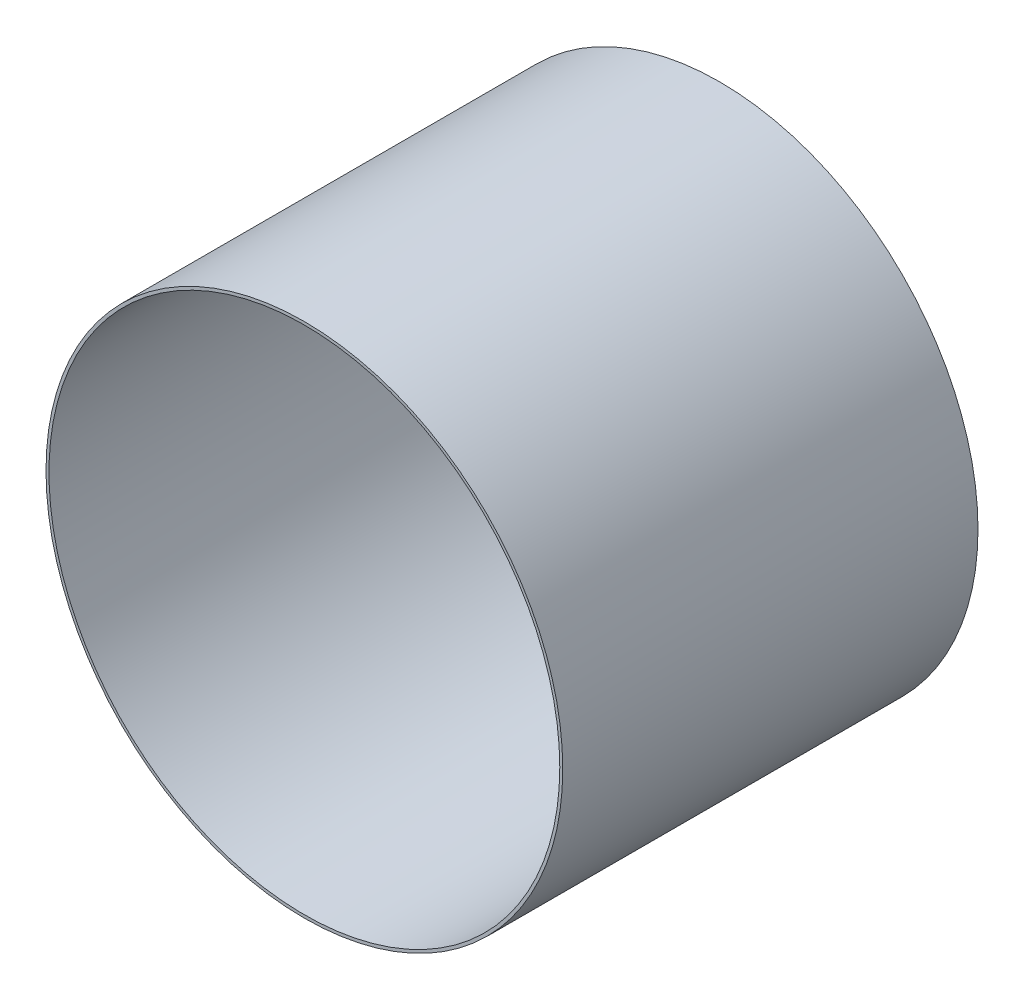
ISO-10303-21;
HEADER;
FILE_DESCRIPTION(('STEP AP214'),'2;1');
FILE_NAME('part.step','',(''),(''),'','','');
FILE_SCHEMA(('AUTOMOTIVE_DESIGN { 1 0 10303 214 1 1 1 1 }'));
ENDSEC;
DATA;
#1=APPLICATION_CONTEXT('core data for automotive mechanical design processes');
#2=APPLICATION_PROTOCOL_DEFINITION('international standard','automotive_design',2000,#1);
#3=PRODUCT_CONTEXT('',#1,'mechanical');
#4=PRODUCT('Part','Part','',(#3));
#5=PRODUCT_RELATED_PRODUCT_CATEGORY('part','',(#4));
#6=PRODUCT_DEFINITION_FORMATION('','',#4);
#7=PRODUCT_DEFINITION_CONTEXT('part definition',#1,'design');
#8=PRODUCT_DEFINITION('design','',#6,#7);
#9=PRODUCT_DEFINITION_SHAPE('','',#8);
#10=(LENGTH_UNIT() NAMED_UNIT(*) SI_UNIT(.MILLI.,.METRE.));
#11=(NAMED_UNIT(*) PLANE_ANGLE_UNIT() SI_UNIT($,.RADIAN.));
#12=(NAMED_UNIT(*) SI_UNIT($,.STERADIAN.) SOLID_ANGLE_UNIT());
#13=UNCERTAINTY_MEASURE_WITH_UNIT(LENGTH_MEASURE(1.E-05),#10,'distance_accuracy_value','');
#14=(GEOMETRIC_REPRESENTATION_CONTEXT(3) GLOBAL_UNCERTAINTY_ASSIGNED_CONTEXT((#13)) GLOBAL_UNIT_ASSIGNED_CONTEXT((#10,
#11,#12)) REPRESENTATION_CONTEXT('',''));
#15=CARTESIAN_POINT('',(0.,0.,0.));
#16=DIRECTION('',(0.,0.,1.));
#17=DIRECTION('',(1.,0.,0.));
#18=AXIS2_PLACEMENT_3D('',#15,#16,#17);
#19=CARTESIAN_POINT('',(0.,0.,140.));
#20=DIRECTION('',(0.,0.,1.));
#21=DIRECTION('',(1.,0.,0.));
#22=AXIS2_PLACEMENT_3D('',#19,#20,#21);
#23=PLANE('',#22);
#24=CARTESIAN_POINT('',(0.,0.,140.));
#25=DIRECTION('',(0.,0.,1.));
#26=DIRECTION('',(1.,0.,0.));
#27=AXIS2_PLACEMENT_3D('',#24,#25,#26);
#28=CIRCLE('',#27,87.110994186458);
#29=CARTESIAN_POINT('',(87.110994186458,0.,140.));
#30=VERTEX_POINT('',#29);
#31=EDGE_CURVE('E10',#30,#30,#28,.T.);
#32=ORIENTED_EDGE('',*,*,#31,.T.);
#33=EDGE_LOOP('',(#32));
#34=FACE_BOUND('',#33,.T.);
#35=CARTESIAN_POINT('',(0.,0.,140.));
#36=DIRECTION('',(0.,0.,1.));
#37=DIRECTION('',(1.,0.,0.));
#38=AXIS2_PLACEMENT_3D('',#35,#36,#37);
#39=CIRCLE('',#38,86.110994186458);
#40=CARTESIAN_POINT('',(86.110994186458,0.,140.));
#41=VERTEX_POINT('',#40);
#42=EDGE_CURVE('E42',#41,#41,#39,.T.);
#43=ORIENTED_EDGE('',*,*,#42,.F.);
#44=EDGE_LOOP('',(#43));
#45=FACE_BOUND('',#44,.T.);
#46=ADVANCED_FACE('F31',(#34,#45),#23,.T.);
#47=CARTESIAN_POINT('',(0.,0.,0.));
#48=DIRECTION('',(0.,0.,1.));
#49=DIRECTION('',(1.,0.,0.));
#50=AXIS2_PLACEMENT_3D('',#47,#48,#49);
#51=PLANE('',#50);
#52=CARTESIAN_POINT('',(0.,0.,0.));
#53=DIRECTION('',(0.,0.,1.));
#54=DIRECTION('',(1.,0.,0.));
#55=AXIS2_PLACEMENT_3D('',#52,#53,#54);
#56=CIRCLE('',#55,87.110994186458);
#57=CARTESIAN_POINT('',(87.110994186458,0.,0.));
#58=VERTEX_POINT('',#57);
#59=EDGE_CURVE('E35',#58,#58,#56,.T.);
#60=ORIENTED_EDGE('',*,*,#59,.F.);
#61=EDGE_LOOP('',(#60));
#62=FACE_BOUND('',#61,.T.);
#63=CARTESIAN_POINT('',(0.,0.,0.));
#64=DIRECTION('',(0.,0.,1.));
#65=DIRECTION('',(1.,0.,0.));
#66=AXIS2_PLACEMENT_3D('',#63,#64,#65);
#67=CIRCLE('',#66,86.110994186458);
#68=CARTESIAN_POINT('',(86.110994186458,0.,0.));
#69=VERTEX_POINT('',#68);
#70=EDGE_CURVE('E44',#69,#69,#67,.T.);
#71=ORIENTED_EDGE('',*,*,#70,.T.);
#72=EDGE_LOOP('',(#71));
#73=FACE_BOUND('',#72,.T.);
#74=ADVANCED_FACE('F54',(#62,#73),#51,.F.);
#75=CARTESIAN_POINT('',(0.,0.,140.));
#76=DIRECTION('',(0.,0.,-1.));
#77=DIRECTION('',(-1.,0.,0.));
#78=AXIS2_PLACEMENT_3D('',#75,#76,#77);
#79=CYLINDRICAL_SURFACE('',#78,87.110994186458);
#80=ORIENTED_EDGE('',*,*,#31,.F.);
#81=EDGE_LOOP('',(#80));
#82=FACE_BOUND('',#81,.T.);
#83=ORIENTED_EDGE('',*,*,#59,.T.);
#84=EDGE_LOOP('',(#83));
#85=FACE_BOUND('',#84,.T.);
#86=ADVANCED_FACE('F33',(#82,#85),#79,.T.);
#87=CARTESIAN_POINT('',(0.,0.,140.));
#88=DIRECTION('',(0.,0.,-1.));
#89=DIRECTION('',(-1.,0.,0.));
#90=AXIS2_PLACEMENT_3D('',#87,#88,#89);
#91=CYLINDRICAL_SURFACE('',#90,86.110994186458);
#92=ORIENTED_EDGE('',*,*,#42,.T.);
#93=EDGE_LOOP('',(#92));
#94=FACE_BOUND('',#93,.T.);
#95=ORIENTED_EDGE('',*,*,#70,.F.);
#96=EDGE_LOOP('',(#95));
#97=FACE_BOUND('',#96,.T.);
#98=ADVANCED_FACE('F50',(#94,#97),#91,.F.);
#99=CLOSED_SHELL('',(#46,#74,#86,#98));
#100=MANIFOLD_SOLID_BREP('B2',#99);
#101=ADVANCED_BREP_SHAPE_REPRESENTATION('',(#18,#100),#14);
#102=SHAPE_DEFINITION_REPRESENTATION(#9,#101);
ENDSEC;
END-ISO-10303-21;
